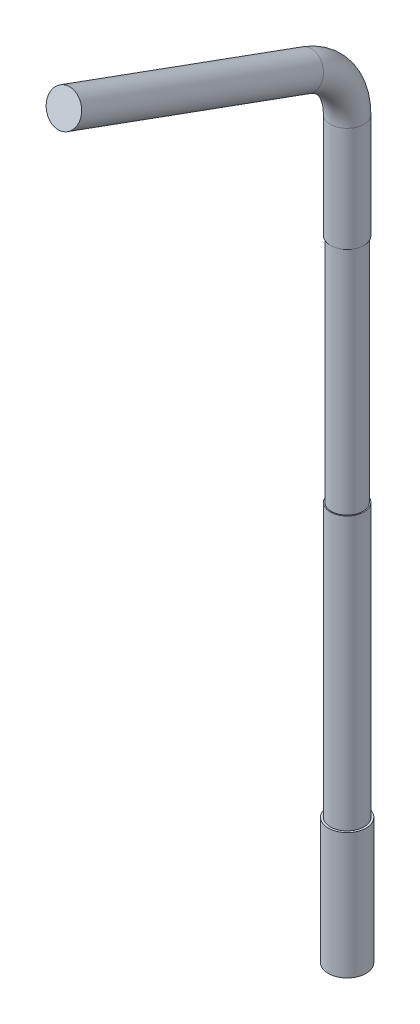
ISO-10303-21;
HEADER;
FILE_DESCRIPTION(('STEP AP214'),'2;1');
FILE_NAME('part.step','',(''),(''),'','','');
FILE_SCHEMA(('AUTOMOTIVE_DESIGN { 1 0 10303 214 1 1 1 1 }'));
ENDSEC;
DATA;
#1=APPLICATION_CONTEXT('core data for automotive mechanical design processes');
#2=APPLICATION_PROTOCOL_DEFINITION('international standard','automotive_design',2000,#1);
#3=PRODUCT_CONTEXT('',#1,'mechanical');
#4=PRODUCT('Part','Part','',(#3));
#5=PRODUCT_RELATED_PRODUCT_CATEGORY('part','',(#4));
#6=PRODUCT_DEFINITION_FORMATION('','',#4);
#7=PRODUCT_DEFINITION_CONTEXT('part definition',#1,'design');
#8=PRODUCT_DEFINITION('design','',#6,#7);
#9=PRODUCT_DEFINITION_SHAPE('','',#8);
#10=(LENGTH_UNIT() NAMED_UNIT(*) SI_UNIT(.MILLI.,.METRE.));
#11=(NAMED_UNIT(*) PLANE_ANGLE_UNIT() SI_UNIT($,.RADIAN.));
#12=(NAMED_UNIT(*) SI_UNIT($,.STERADIAN.) SOLID_ANGLE_UNIT());
#13=UNCERTAINTY_MEASURE_WITH_UNIT(LENGTH_MEASURE(1.E-05),#10,'distance_accuracy_value','');
#14=(GEOMETRIC_REPRESENTATION_CONTEXT(3) GLOBAL_UNCERTAINTY_ASSIGNED_CONTEXT((#13)) GLOBAL_UNIT_ASSIGNED_CONTEXT((#10,
#11,#12)) REPRESENTATION_CONTEXT('',''));
#15=CARTESIAN_POINT('',(0.,0.,0.));
#16=DIRECTION('',(0.,0.,1.));
#17=DIRECTION('',(1.,0.,0.));
#18=AXIS2_PLACEMENT_3D('',#15,#16,#17);
#19=CARTESIAN_POINT('',(0.,37.8190778623577,-2.526060429977));
#20=DIRECTION('',(0.,0.342020143325665,0.93969262078591));
#21=DIRECTION('',(0.,-0.93969262078591,0.342020143325665));
#22=AXIS2_PLACEMENT_3D('',#19,#20,#21);
#23=CYLINDRICAL_SURFACE('',#22,0.8);
#24=CARTESIAN_POINT('',(0.,37.8190778623577,-2.526060429977));
#25=DIRECTION('',(0.,0.342020143325665,0.93969262078591));
#26=DIRECTION('',(0.,-0.93969262078591,0.342020143325665));
#27=AXIS2_PLACEMENT_3D('',#24,#25,#26);
#28=CIRCLE('',#27,0.8);
#29=CARTESIAN_POINT('',(0.,38.5708319589865,-2.79967654463753));
#30=VERTEX_POINT('',#29);
#31=EDGE_CURVE('E38',#30,#30,#28,.T.);
#32=ORIENTED_EDGE('',*,*,#31,.T.);
#33=EDGE_LOOP('',(#32));
#34=FACE_BOUND('',#33,.T.);
#35=CARTESIAN_POINT('',(0.,42.0142207772228,9.));
#36=DIRECTION('',(0.,0.342020143325665,0.93969262078591));
#37=DIRECTION('',(0.,-0.93969262078591,0.342020143325665));
#38=AXIS2_PLACEMENT_3D('',#35,#36,#37);
#39=CIRCLE('',#38,0.8);
#40=CARTESIAN_POINT('',(0.,41.2624666805941,9.27361611466053));
#41=VERTEX_POINT('',#40);
#42=EDGE_CURVE('E11',#41,#41,#39,.T.);
#43=ORIENTED_EDGE('',*,*,#42,.F.);
#44=EDGE_LOOP('',(#43));
#45=FACE_BOUND('',#44,.T.);
#46=ADVANCED_FACE('F31',(#34,#45),#23,.T.);
#47=CARTESIAN_POINT('',(0.,35.,-1.5));
#48=DIRECTION('',(1.,0.,0.));
#49=DIRECTION('',(0.,0.,-1.));
#50=AXIS2_PLACEMENT_3D('',#47,#48,#49);
#51=TOROIDAL_SURFACE('',#50,3.,0.8);
#52=CARTESIAN_POINT('',(0.,35.,-4.5));
#53=DIRECTION('',(0.,1.,0.));
#54=DIRECTION('',(0.,0.,1.));
#55=AXIS2_PLACEMENT_3D('',#52,#53,#54);
#56=CIRCLE('',#55,0.8);
#57=CARTESIAN_POINT('',(0.,35.,-5.3));
#58=VERTEX_POINT('',#57);
#59=EDGE_CURVE('E43',#58,#58,#56,.T.);
#60=CARTESIAN_POINT('',(0.,35.,-1.5));
#61=DIRECTION('',(1.,0.,0.));
#62=DIRECTION('',(0.,0.,-1.));
#63=AXIS2_PLACEMENT_3D('',#60,#61,#62);
#64=CIRCLE('',#63,3.8);
#65=EDGE_CURVE('',#58,#30,#64,.T.);
#66=ORIENTED_EDGE('',*,*,#59,.T.);
#67=ORIENTED_EDGE('',*,*,#31,.F.);
#68=ORIENTED_EDGE('',*,*,#65,.T.);
#69=ORIENTED_EDGE('',*,*,#65,.F.);
#70=EDGE_LOOP('',(#66,#68,#67,#69));
#71=FACE_BOUND('',#70,.T.);
#72=ADVANCED_FACE('F71',(#71),#51,.T.);
#73=CARTESIAN_POINT('',(0.,35.,-4.5));
#74=DIRECTION('',(0.,-1.,0.));
#75=DIRECTION('',(0.,0.,-1.));
#76=AXIS2_PLACEMENT_3D('',#73,#74,#75);
#77=CYLINDRICAL_SURFACE('',#76,0.8);
#78=CARTESIAN_POINT('',(0.,30.,-4.5));
#79=DIRECTION('',(0.,1.,0.));
#80=DIRECTION('',(0.,0.,1.));
#81=AXIS2_PLACEMENT_3D('',#78,#79,#80);
#82=CIRCLE('',#81,0.8);
#83=CARTESIAN_POINT('',(0.,30.,-3.7));
#84=VERTEX_POINT('',#83);
#85=EDGE_CURVE('E34',#84,#84,#82,.T.);
#86=ORIENTED_EDGE('',*,*,#85,.T.);
#87=EDGE_LOOP('',(#86));
#88=FACE_BOUND('',#87,.T.);
#89=ORIENTED_EDGE('',*,*,#59,.F.);
#90=EDGE_LOOP('',(#89));
#91=FACE_BOUND('',#90,.T.);
#92=ADVANCED_FACE('F74',(#88,#91),#77,.T.);
#93=CARTESIAN_POINT('',(0.,42.0142207772228,9.));
#94=DIRECTION('',(0.,0.342020143325665,0.93969262078591));
#95=DIRECTION('',(0.,-0.93969262078591,0.342020143325665));
#96=AXIS2_PLACEMENT_3D('',#93,#94,#95);
#97=PLANE('',#96);
#98=ORIENTED_EDGE('',*,*,#42,.T.);
#99=EDGE_LOOP('',(#98));
#100=FACE_BOUND('',#99,.T.);
#101=ADVANCED_FACE('F76',(#100),#97,.T.);
#102=CARTESIAN_POINT('',(0.,30.,1.93680805733027));
#103=DIRECTION('',(0.,1.,0.));
#104=DIRECTION('',(0.,0.,1.));
#105=AXIS2_PLACEMENT_3D('',#102,#103,#104);
#106=PLANE('',#105);
#107=CARTESIAN_POINT('',(0.,30.,-4.5));
#108=DIRECTION('',(0.,1.,0.));
#109=DIRECTION('',(0.,0.,1.));
#110=AXIS2_PLACEMENT_3D('',#107,#108,#109);
#111=CIRCLE('',#110,0.75);
#112=CARTESIAN_POINT('',(0.,30.,-3.75));
#113=VERTEX_POINT('',#112);
#114=EDGE_CURVE('E52',#113,#113,#111,.T.);
#115=ORIENTED_EDGE('',*,*,#114,.T.);
#116=EDGE_LOOP('',(#115));
#117=FACE_BOUND('',#116,.T.);
#118=ORIENTED_EDGE('',*,*,#85,.F.);
#119=EDGE_LOOP('',(#118));
#120=FACE_BOUND('',#119,.T.);
#121=ADVANCED_FACE('F84',(#117,#120),#106,.F.);
#122=CARTESIAN_POINT('',(0.,19.,1.93680805733027));
#123=DIRECTION('',(0.,1.,0.));
#124=DIRECTION('',(0.,0.,1.));
#125=AXIS2_PLACEMENT_3D('',#122,#123,#124);
#126=PLANE('',#125);
#127=CARTESIAN_POINT('',(0.,19.,-4.5));
#128=DIRECTION('',(0.,1.,0.));
#129=DIRECTION('',(0.,0.,1.));
#130=AXIS2_PLACEMENT_3D('',#127,#128,#129);
#131=CIRCLE('',#130,0.75);
#132=CARTESIAN_POINT('',(0.,19.,-3.75));
#133=VERTEX_POINT('',#132);
#134=EDGE_CURVE('E58',#133,#133,#131,.T.);
#135=ORIENTED_EDGE('',*,*,#134,.F.);
#136=EDGE_LOOP('',(#135));
#137=FACE_BOUND('',#136,.T.);
#138=CARTESIAN_POINT('',(0.,19.,-4.5));
#139=DIRECTION('',(0.,1.,0.));
#140=DIRECTION('',(0.,0.,1.));
#141=AXIS2_PLACEMENT_3D('',#138,#139,#140);
#142=CIRCLE('',#141,0.8);
#143=CARTESIAN_POINT('',(0.,19.,-3.7));
#144=VERTEX_POINT('',#143);
#145=EDGE_CURVE('E50',#144,#144,#142,.T.);
#146=ORIENTED_EDGE('',*,*,#145,.T.);
#147=EDGE_LOOP('',(#146));
#148=FACE_BOUND('',#147,.T.);
#149=ADVANCED_FACE('F151',(#137,#148),#126,.T.);
#150=CARTESIAN_POINT('',(0.,30.,-4.5));
#151=DIRECTION('',(0.,-1.,0.));
#152=DIRECTION('',(0.,0.,-1.));
#153=AXIS2_PLACEMENT_3D('',#150,#151,#152);
#154=CYLINDRICAL_SURFACE('',#153,0.75);
#155=ORIENTED_EDGE('',*,*,#114,.F.);
#156=EDGE_LOOP('',(#155));
#157=FACE_BOUND('',#156,.T.);
#158=ORIENTED_EDGE('',*,*,#134,.T.);
#159=EDGE_LOOP('',(#158));
#160=FACE_BOUND('',#159,.T.);
#161=ADVANCED_FACE('F137',(#157,#160),#154,.T.);
#162=CARTESIAN_POINT('',(0.,0.,-4.5));
#163=DIRECTION('',(0.,1.,0.));
#164=DIRECTION('',(0.,0.,1.));
#165=AXIS2_PLACEMENT_3D('',#162,#163,#164);
#166=PLANE('',#165);
#167=CARTESIAN_POINT('',(0.,0.,-4.5));
#168=DIRECTION('',(0.,1.,0.));
#169=DIRECTION('',(0.,0.,1.));
#170=AXIS2_PLACEMENT_3D('',#167,#168,#169);
#171=CIRCLE('',#170,0.899999999999999);
#172=CARTESIAN_POINT('',(0.,0.,-3.6));
#173=VERTEX_POINT('',#172);
#174=EDGE_CURVE('E56',#173,#173,#171,.T.);
#175=ORIENTED_EDGE('',*,*,#174,.F.);
#176=EDGE_LOOP('',(#175));
#177=FACE_BOUND('',#176,.T.);
#178=ADVANCED_FACE('F128',(#177),#166,.F.);
#179=CARTESIAN_POINT('',(0.,6.,-4.5));
#180=DIRECTION('',(0.,-1.,0.));
#181=DIRECTION('',(0.,0.,-1.));
#182=AXIS2_PLACEMENT_3D('',#179,#180,#181);
#183=CYLINDRICAL_SURFACE('',#182,0.899999999999999);
#184=CARTESIAN_POINT('',(0.,6.,-4.5));
#185=DIRECTION('',(0.,1.,0.));
#186=DIRECTION('',(0.,0.,1.));
#187=AXIS2_PLACEMENT_3D('',#184,#185,#186);
#188=CIRCLE('',#187,0.899999999999999);
#189=CARTESIAN_POINT('',(0.,6.,-3.6));
#190=VERTEX_POINT('',#189);
#191=EDGE_CURVE('E49',#190,#190,#188,.T.);
#192=ORIENTED_EDGE('',*,*,#191,.F.);
#193=EDGE_LOOP('',(#192));
#194=FACE_BOUND('',#193,.T.);
#195=ORIENTED_EDGE('',*,*,#174,.T.);
#196=EDGE_LOOP('',(#195));
#197=FACE_BOUND('',#196,.T.);
#198=ADVANCED_FACE('F118',(#194,#197),#183,.T.);
#199=CARTESIAN_POINT('',(0.,6.,-4.5));
#200=DIRECTION('',(0.,1.,0.));
#201=DIRECTION('',(0.,0.,1.));
#202=AXIS2_PLACEMENT_3D('',#199,#200,#201);
#203=PLANE('',#202);
#204=ORIENTED_EDGE('',*,*,#191,.T.);
#205=EDGE_LOOP('',(#204));
#206=FACE_BOUND('',#205,.T.);
#207=CARTESIAN_POINT('',(0.,6.,-4.5));
#208=DIRECTION('',(0.,1.,0.));
#209=DIRECTION('',(0.,0.,1.));
#210=AXIS2_PLACEMENT_3D('',#207,#208,#209);
#211=CIRCLE('',#210,0.8);
#212=CARTESIAN_POINT('',(0.,6.,-3.7));
#213=VERTEX_POINT('',#212);
#214=EDGE_CURVE('E47',#213,#213,#211,.T.);
#215=ORIENTED_EDGE('',*,*,#214,.F.);
#216=EDGE_LOOP('',(#215));
#217=FACE_BOUND('',#216,.T.);
#218=ADVANCED_FACE('F88',(#206,#217),#203,.T.);
#219=ORIENTED_EDGE('',*,*,#214,.T.);
#220=EDGE_LOOP('',(#219));
#221=FACE_BOUND('',#220,.T.);
#222=ORIENTED_EDGE('',*,*,#145,.F.);
#223=EDGE_LOOP('',(#222));
#224=FACE_BOUND('',#223,.T.);
#225=ADVANCED_FACE('F79',(#221,#224),#77,.T.);
#226=CLOSED_SHELL('',(#46,#72,#92,#101,#121,#149,#161,#178,#198,#218,#225));
#227=MANIFOLD_SOLID_BREP('B2',#226);
#228=ADVANCED_BREP_SHAPE_REPRESENTATION('',(#18,#227),#14);
#229=SHAPE_DEFINITION_REPRESENTATION(#9,#228);
ENDSEC;
END-ISO-10303-21;
